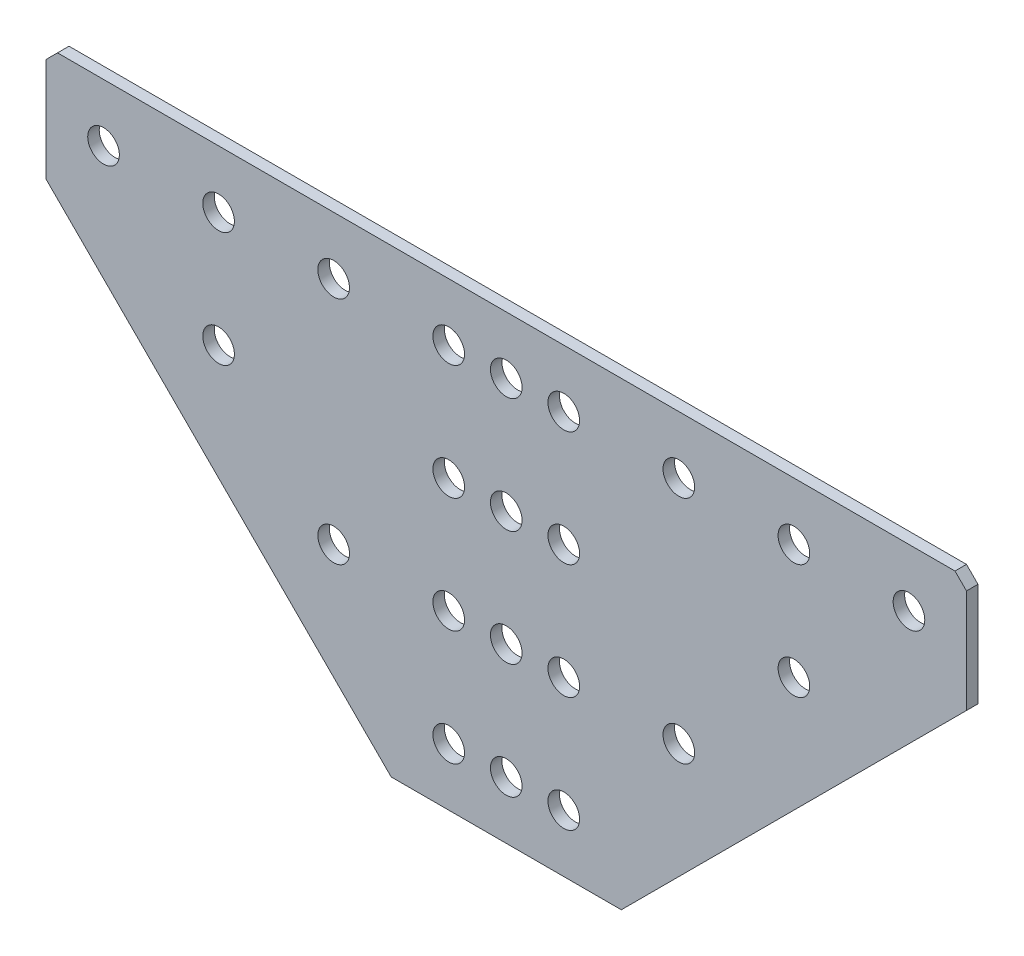
ISO-10303-21;
HEADER;
FILE_DESCRIPTION(('STEP AP214'),'2;1');
FILE_NAME('part.step','',(''),(''),'','','');
FILE_SCHEMA(('AUTOMOTIVE_DESIGN { 1 0 10303 214 1 1 1 1 }'));
ENDSEC;
DATA;
#1=APPLICATION_CONTEXT('core data for automotive mechanical design processes');
#2=APPLICATION_PROTOCOL_DEFINITION('international standard','automotive_design',2000,#1);
#3=PRODUCT_CONTEXT('',#1,'mechanical');
#4=PRODUCT('Part','Part','',(#3));
#5=PRODUCT_RELATED_PRODUCT_CATEGORY('part','',(#4));
#6=PRODUCT_DEFINITION_FORMATION('','',#4);
#7=PRODUCT_DEFINITION_CONTEXT('part definition',#1,'design');
#8=PRODUCT_DEFINITION('design','',#6,#7);
#9=PRODUCT_DEFINITION_SHAPE('','',#8);
#10=(LENGTH_UNIT() NAMED_UNIT(*) SI_UNIT(.MILLI.,.METRE.));
#11=(NAMED_UNIT(*) PLANE_ANGLE_UNIT() SI_UNIT($,.RADIAN.));
#12=(NAMED_UNIT(*) SI_UNIT($,.STERADIAN.) SOLID_ANGLE_UNIT());
#13=UNCERTAINTY_MEASURE_WITH_UNIT(LENGTH_MEASURE(1.E-05),#10,'distance_accuracy_value','');
#14=(GEOMETRIC_REPRESENTATION_CONTEXT(3) GLOBAL_UNCERTAINTY_ASSIGNED_CONTEXT((#13)) GLOBAL_UNIT_ASSIGNED_CONTEXT((#10,
#11,#12)) REPRESENTATION_CONTEXT('',''));
#15=CARTESIAN_POINT('',(0.,0.,0.));
#16=DIRECTION('',(0.,0.,1.));
#17=DIRECTION('',(1.,0.,0.));
#18=AXIS2_PLACEMENT_3D('',#15,#16,#17);
#19=CARTESIAN_POINT('',(0.,0.,-2.));
#20=DIRECTION('',(0.,-1.,0.));
#21=DIRECTION('',(0.,0.,-1.));
#22=AXIS2_PLACEMENT_3D('',#19,#20,#21);
#23=PLANE('',#22);
#24=DIRECTION('',(1.,0.,0.));
#25=VECTOR('',#24,1.);
#26=CARTESIAN_POINT('',(0.,0.,0.));
#27=LINE('',#26,#25);
#28=CARTESIAN_POINT('',(-20.,0.,0.));
#29=VERTEX_POINT('',#28);
#30=CARTESIAN_POINT('',(20.,0.,0.));
#31=VERTEX_POINT('',#30);
#32=EDGE_CURVE('E135',#29,#31,#27,.T.);
#33=ORIENTED_EDGE('',*,*,#32,.F.);
#34=DIRECTION('',(0.,0.,1.));
#35=VECTOR('',#34,1.);
#36=CARTESIAN_POINT('',(-20.,0.,-2.));
#37=LINE('',#36,#35);
#38=CARTESIAN_POINT('',(-20.,0.,-2.));
#39=VERTEX_POINT('',#38);
#40=EDGE_CURVE('E127',#39,#29,#37,.T.);
#41=ORIENTED_EDGE('',*,*,#40,.F.);
#42=DIRECTION('',(1.,0.,0.));
#43=VECTOR('',#42,1.);
#44=CARTESIAN_POINT('',(0.,0.,-2.));
#45=LINE('',#44,#43);
#46=CARTESIAN_POINT('',(20.,0.,-2.));
#47=VERTEX_POINT('',#46);
#48=EDGE_CURVE('E110',#39,#47,#45,.T.);
#49=ORIENTED_EDGE('',*,*,#48,.T.);
#50=DIRECTION('',(0.,0.,1.));
#51=VECTOR('',#50,1.);
#52=CARTESIAN_POINT('',(20.,0.,-2.));
#53=LINE('',#52,#51);
#54=EDGE_CURVE('E227',#47,#31,#53,.T.);
#55=ORIENTED_EDGE('',*,*,#54,.T.);
#56=EDGE_LOOP('',(#33,#41,#49,#55));
#57=FACE_BOUND('',#56,.T.);
#58=ADVANCED_FACE('F44',(#57),#23,.T.);
#59=CARTESIAN_POINT('',(0.,80.,-2.));
#60=DIRECTION('',(0.,1.,0.));
#61=DIRECTION('',(0.,0.,1.));
#62=AXIS2_PLACEMENT_3D('',#59,#60,#61);
#63=PLANE('',#62);
#64=DIRECTION('',(-1.,0.,0.));
#65=VECTOR('',#64,1.);
#66=CARTESIAN_POINT('',(0.,80.,0.));
#67=LINE('',#66,#65);
#68=CARTESIAN_POINT('',(78.,80.,0.));
#69=VERTEX_POINT('',#68);
#70=CARTESIAN_POINT('',(-78.,80.,0.));
#71=VERTEX_POINT('',#70);
#72=EDGE_CURVE('E122',#69,#71,#67,.T.);
#73=ORIENTED_EDGE('',*,*,#72,.F.);
#74=DIRECTION('',(0.,0.,-1.));
#75=VECTOR('',#74,1.);
#76=CARTESIAN_POINT('',(78.,80.,-2.));
#77=LINE('',#76,#75);
#78=CARTESIAN_POINT('',(78.,80.,-2.));
#79=VERTEX_POINT('',#78);
#80=EDGE_CURVE('E260',#69,#79,#77,.T.);
#81=ORIENTED_EDGE('',*,*,#80,.T.);
#82=DIRECTION('',(-1.,0.,0.));
#83=VECTOR('',#82,1.);
#84=CARTESIAN_POINT('',(0.,80.,-2.));
#85=LINE('',#84,#83);
#86=CARTESIAN_POINT('',(-78.,80.,-2.));
#87=VERTEX_POINT('',#86);
#88=EDGE_CURVE('E224',#79,#87,#85,.T.);
#89=ORIENTED_EDGE('',*,*,#88,.T.);
#90=DIRECTION('',(0.,0.,1.));
#91=VECTOR('',#90,1.);
#92=CARTESIAN_POINT('',(-78.,80.,-2.));
#93=LINE('',#92,#91);
#94=EDGE_CURVE('E256',#87,#71,#93,.T.);
#95=ORIENTED_EDGE('',*,*,#94,.T.);
#96=EDGE_LOOP('',(#73,#81,#89,#95));
#97=FACE_BOUND('',#96,.T.);
#98=ADVANCED_FACE('F279',(#97),#63,.T.);
#99=CARTESIAN_POINT('',(80.,80.,-2.));
#100=DIRECTION('',(1.,0.,0.));
#101=DIRECTION('',(0.,0.,-1.));
#102=AXIS2_PLACEMENT_3D('',#99,#100,#101);
#103=PLANE('',#102);
#104=DIRECTION('',(0.,1.,0.));
#105=VECTOR('',#104,1.);
#106=CARTESIAN_POINT('',(80.,80.,-2.));
#107=LINE('',#106,#105);
#108=CARTESIAN_POINT('',(80.,60.,-2.));
#109=VERTEX_POINT('',#108);
#110=CARTESIAN_POINT('',(80.,78.,-2.));
#111=VERTEX_POINT('',#110);
#112=EDGE_CURVE('E220',#109,#111,#107,.T.);
#113=ORIENTED_EDGE('',*,*,#112,.T.);
#114=DIRECTION('',(0.,0.,1.));
#115=VECTOR('',#114,1.);
#116=CARTESIAN_POINT('',(80.,78.,-2.));
#117=LINE('',#116,#115);
#118=CARTESIAN_POINT('',(80.,78.,0.));
#119=VERTEX_POINT('',#118);
#120=EDGE_CURVE('E244',#111,#119,#117,.T.);
#121=ORIENTED_EDGE('',*,*,#120,.T.);
#122=DIRECTION('',(0.,1.,0.));
#123=VECTOR('',#122,1.);
#124=CARTESIAN_POINT('',(80.,80.,0.));
#125=LINE('',#124,#123);
#126=CARTESIAN_POINT('',(80.,60.,0.));
#127=VERTEX_POINT('',#126);
#128=EDGE_CURVE('E234',#127,#119,#125,.T.);
#129=ORIENTED_EDGE('',*,*,#128,.F.);
#130=DIRECTION('',(0.,0.,1.));
#131=VECTOR('',#130,1.);
#132=CARTESIAN_POINT('',(80.,60.,-2.));
#133=LINE('',#132,#131);
#134=EDGE_CURVE('E241',#109,#127,#133,.T.);
#135=ORIENTED_EDGE('',*,*,#134,.F.);
#136=EDGE_LOOP('',(#113,#121,#129,#135));
#137=FACE_BOUND('',#136,.T.);
#138=ADVANCED_FACE('F271',(#137),#103,.T.);
#139=CARTESIAN_POINT('',(80.,60.,-2.));
#140=DIRECTION('',(0.707106781186547,-0.707106781186547,0.));
#141=DIRECTION('',(0.707106781186548,0.707106781186548,0.));
#142=AXIS2_PLACEMENT_3D('',#139,#140,#141);
#143=PLANE('',#142);
#144=DIRECTION('',(0.707106781186547,0.707106781186547,0.));
#145=VECTOR('',#144,1.);
#146=CARTESIAN_POINT('',(80.,60.,0.));
#147=LINE('',#146,#145);
#148=EDGE_CURVE('E230',#31,#127,#147,.T.);
#149=ORIENTED_EDGE('',*,*,#148,.F.);
#150=ORIENTED_EDGE('',*,*,#54,.F.);
#151=DIRECTION('',(0.707106781186547,0.707106781186547,0.));
#152=VECTOR('',#151,1.);
#153=CARTESIAN_POINT('',(80.,60.,-2.));
#154=LINE('',#153,#152);
#155=EDGE_CURVE('E118',#47,#109,#154,.T.);
#156=ORIENTED_EDGE('',*,*,#155,.T.);
#157=ORIENTED_EDGE('',*,*,#134,.T.);
#158=EDGE_LOOP('',(#149,#150,#156,#157));
#159=FACE_BOUND('',#158,.T.);
#160=ADVANCED_FACE('F401',(#159),#143,.T.);
#161=CARTESIAN_POINT('',(0.,0.,-2.));
#162=DIRECTION('',(0.,0.,-1.));
#163=DIRECTION('',(-1.,0.,0.));
#164=AXIS2_PLACEMENT_3D('',#161,#162,#163);
#165=PLANE('',#164);
#166=CARTESIAN_POINT('',(0.,70.,-2.));
#167=DIRECTION('',(0.,0.,-1.));
#168=DIRECTION('',(-1.,0.,0.));
#169=AXIS2_PLACEMENT_3D('',#166,#167,#168);
#170=CIRCLE('',#169,2.74999999999999);
#171=CARTESIAN_POINT('',(-2.74999999999999,70.,-2.));
#172=VERTEX_POINT('',#171);
#173=EDGE_CURVE('E390',#172,#172,#170,.T.);
#174=ORIENTED_EDGE('',*,*,#173,.F.);
#175=EDGE_LOOP('',(#174));
#176=FACE_BOUND('',#175,.T.);
#177=CARTESIAN_POINT('',(-2.09488880330588E-13,50.,-2.));
#178=DIRECTION('',(0.,0.,-1.));
#179=DIRECTION('',(-1.,0.,0.));
#180=AXIS2_PLACEMENT_3D('',#177,#178,#179);
#181=CIRCLE('',#180,2.74999999999999);
#182=CARTESIAN_POINT('',(-2.7500000000002,50.,-2.));
#183=VERTEX_POINT('',#182);
#184=EDGE_CURVE('E382',#183,#183,#181,.T.);
#185=ORIENTED_EDGE('',*,*,#184,.F.);
#186=EDGE_LOOP('',(#185));
#187=FACE_BOUND('',#186,.T.);
#188=CARTESIAN_POINT('',(-4.18977760661176E-13,30.,-2.));
#189=DIRECTION('',(0.,0.,-1.));
#190=DIRECTION('',(-1.,0.,0.));
#191=AXIS2_PLACEMENT_3D('',#188,#189,#190);
#192=CIRCLE('',#191,2.74999999999999);
#193=CARTESIAN_POINT('',(-2.75000000000041,30.,-2.));
#194=VERTEX_POINT('',#193);
#195=EDGE_CURVE('E374',#194,#194,#192,.T.);
#196=ORIENTED_EDGE('',*,*,#195,.F.);
#197=EDGE_LOOP('',(#196));
#198=FACE_BOUND('',#197,.T.);
#199=CARTESIAN_POINT('',(-6.28466640991764E-13,9.99999999999999,-2.));
#200=DIRECTION('',(0.,0.,-1.));
#201=DIRECTION('',(-1.,0.,0.));
#202=AXIS2_PLACEMENT_3D('',#199,#200,#201);
#203=CIRCLE('',#202,2.74999999999999);
#204=CARTESIAN_POINT('',(-2.75000000000062,9.99999999999999,-2.));
#205=VERTEX_POINT('',#204);
#206=EDGE_CURVE('E366',#205,#205,#203,.T.);
#207=ORIENTED_EDGE('',*,*,#206,.F.);
#208=EDGE_LOOP('',(#207));
#209=FACE_BOUND('',#208,.T.);
#210=CARTESIAN_POINT('',(10.,30.,-2.));
#211=DIRECTION('',(0.,0.,-1.));
#212=DIRECTION('',(-1.,0.,0.));
#213=AXIS2_PLACEMENT_3D('',#210,#211,#212);
#214=CIRCLE('',#213,2.75);
#215=CARTESIAN_POINT('',(7.25,30.,-2.));
#216=VERTEX_POINT('',#215);
#217=EDGE_CURVE('E150',#216,#216,#214,.T.);
#218=ORIENTED_EDGE('',*,*,#217,.F.);
#219=EDGE_LOOP('',(#218));
#220=FACE_BOUND('',#219,.T.);
#221=CARTESIAN_POINT('',(50.,70.,-2.));
#222=DIRECTION('',(0.,0.,-1.));
#223=DIRECTION('',(-1.,0.,0.));
#224=AXIS2_PLACEMENT_3D('',#221,#222,#223);
#225=CIRCLE('',#224,2.75);
#226=CARTESIAN_POINT('',(47.25,70.,-2.));
#227=VERTEX_POINT('',#226);
#228=EDGE_CURVE('E158',#227,#227,#225,.T.);
#229=ORIENTED_EDGE('',*,*,#228,.F.);
#230=EDGE_LOOP('',(#229));
#231=FACE_BOUND('',#230,.T.);
#232=CARTESIAN_POINT('',(70.,70.,-2.));
#233=DIRECTION('',(0.,0.,-1.));
#234=DIRECTION('',(-1.,0.,0.));
#235=AXIS2_PLACEMENT_3D('',#232,#233,#234);
#236=CIRCLE('',#235,2.75);
#237=CARTESIAN_POINT('',(67.25,70.,-2.));
#238=VERTEX_POINT('',#237);
#239=EDGE_CURVE('E166',#238,#238,#236,.T.);
#240=ORIENTED_EDGE('',*,*,#239,.F.);
#241=EDGE_LOOP('',(#240));
#242=FACE_BOUND('',#241,.T.);
#243=CARTESIAN_POINT('',(30.,70.,-2.));
#244=DIRECTION('',(0.,0.,-1.));
#245=DIRECTION('',(-1.,0.,0.));
#246=AXIS2_PLACEMENT_3D('',#243,#244,#245);
#247=CIRCLE('',#246,2.75);
#248=CARTESIAN_POINT('',(27.25,70.,-2.));
#249=VERTEX_POINT('',#248);
#250=EDGE_CURVE('E174',#249,#249,#247,.T.);
#251=ORIENTED_EDGE('',*,*,#250,.F.);
#252=EDGE_LOOP('',(#251));
#253=FACE_BOUND('',#252,.T.);
#254=CARTESIAN_POINT('',(10.,70.,-2.));
#255=DIRECTION('',(0.,0.,-1.));
#256=DIRECTION('',(-1.,0.,0.));
#257=AXIS2_PLACEMENT_3D('',#254,#255,#256);
#258=CIRCLE('',#257,2.75);
#259=CARTESIAN_POINT('',(7.25,70.,-2.));
#260=VERTEX_POINT('',#259);
#261=EDGE_CURVE('E182',#260,#260,#258,.T.);
#262=ORIENTED_EDGE('',*,*,#261,.F.);
#263=EDGE_LOOP('',(#262));
#264=FACE_BOUND('',#263,.T.);
#265=CARTESIAN_POINT('',(10.,9.99999999999999,-2.));
#266=DIRECTION('',(0.,0.,-1.));
#267=DIRECTION('',(-1.,0.,0.));
#268=AXIS2_PLACEMENT_3D('',#265,#266,#267);
#269=CIRCLE('',#268,2.75);
#270=CARTESIAN_POINT('',(7.25000000000001,9.99999999999999,-2.));
#271=VERTEX_POINT('',#270);
#272=EDGE_CURVE('E190',#271,#271,#269,.T.);
#273=ORIENTED_EDGE('',*,*,#272,.F.);
#274=EDGE_LOOP('',(#273));
#275=FACE_BOUND('',#274,.T.);
#276=CARTESIAN_POINT('',(10.,50.,-2.));
#277=DIRECTION('',(0.,0.,-1.));
#278=DIRECTION('',(-1.,0.,0.));
#279=AXIS2_PLACEMENT_3D('',#276,#277,#278);
#280=CIRCLE('',#279,2.75);
#281=CARTESIAN_POINT('',(7.25,50.,-2.));
#282=VERTEX_POINT('',#281);
#283=EDGE_CURVE('E198',#282,#282,#280,.T.);
#284=ORIENTED_EDGE('',*,*,#283,.F.);
#285=EDGE_LOOP('',(#284));
#286=FACE_BOUND('',#285,.T.);
#287=CARTESIAN_POINT('',(30.,30.,-2.));
#288=DIRECTION('',(0.,0.,-1.));
#289=DIRECTION('',(-1.,0.,0.));
#290=AXIS2_PLACEMENT_3D('',#287,#288,#289);
#291=CIRCLE('',#290,2.75);
#292=CARTESIAN_POINT('',(27.25,30.,-2.));
#293=VERTEX_POINT('',#292);
#294=EDGE_CURVE('E206',#293,#293,#291,.T.);
#295=ORIENTED_EDGE('',*,*,#294,.F.);
#296=EDGE_LOOP('',(#295));
#297=FACE_BOUND('',#296,.T.);
#298=CARTESIAN_POINT('',(50.,50.,-2.));
#299=DIRECTION('',(0.,0.,-1.));
#300=DIRECTION('',(-1.,0.,0.));
#301=AXIS2_PLACEMENT_3D('',#298,#299,#300);
#302=CIRCLE('',#301,2.75);
#303=CARTESIAN_POINT('',(47.25,50.,-2.));
#304=VERTEX_POINT('',#303);
#305=EDGE_CURVE('E214',#304,#304,#302,.T.);
#306=ORIENTED_EDGE('',*,*,#305,.F.);
#307=EDGE_LOOP('',(#306));
#308=FACE_BOUND('',#307,.T.);
#309=ORIENTED_EDGE('',*,*,#88,.F.);
#310=DIRECTION('',(-0.707106781186552,0.707106781186543,0.));
#311=VECTOR('',#310,1.);
#312=CARTESIAN_POINT('',(78.9999999999994,79.0000000000005,-2.));
#313=LINE('',#312,#311);
#314=EDGE_CURVE('E53',#79,#111,#313,.F.);
#315=ORIENTED_EDGE('',*,*,#314,.T.);
#316=ORIENTED_EDGE('',*,*,#112,.F.);
#317=ORIENTED_EDGE('',*,*,#155,.F.);
#318=ORIENTED_EDGE('',*,*,#48,.F.);
#319=DIRECTION('',(-0.707106781186547,0.707106781186547,0.));
#320=VECTOR('',#319,1.);
#321=CARTESIAN_POINT('',(-80.,60.,-2.));
#322=LINE('',#321,#320);
#323=CARTESIAN_POINT('',(-80.,60.,-2.));
#324=VERTEX_POINT('',#323);
#325=EDGE_CURVE('E114',#39,#324,#322,.T.);
#326=ORIENTED_EDGE('',*,*,#325,.T.);
#327=DIRECTION('',(0.,1.,0.));
#328=VECTOR('',#327,1.);
#329=CARTESIAN_POINT('',(-80.,80.,-2.));
#330=LINE('',#329,#328);
#331=CARTESIAN_POINT('',(-80.,78.,-2.));
#332=VERTEX_POINT('',#331);
#333=EDGE_CURVE('E131',#324,#332,#330,.T.);
#334=ORIENTED_EDGE('',*,*,#333,.T.);
#335=DIRECTION('',(-0.707106781186543,-0.707106781186552,0.));
#336=VECTOR('',#335,1.);
#337=CARTESIAN_POINT('',(-79.0000000000005,78.9999999999994,-2.));
#338=LINE('',#337,#336);
#339=EDGE_CURVE('E65',#332,#87,#338,.F.);
#340=ORIENTED_EDGE('',*,*,#339,.T.);
#341=EDGE_LOOP('',(#309,#315,#316,#317,#318,#326,#334,#340));
#342=FACE_BOUND('',#341,.T.);
#343=CARTESIAN_POINT('',(-10.,30.,-2.));
#344=DIRECTION('',(0.,0.,1.));
#345=DIRECTION('',(1.,0.,0.));
#346=AXIS2_PLACEMENT_3D('',#343,#344,#345);
#347=CIRCLE('',#346,2.75);
#348=CARTESIAN_POINT('',(-7.25,30.,-2.));
#349=VERTEX_POINT('',#348);
#350=EDGE_CURVE('E354',#349,#349,#347,.T.);
#351=ORIENTED_EDGE('',*,*,#350,.T.);
#352=EDGE_LOOP('',(#351));
#353=FACE_BOUND('',#352,.T.);
#354=CARTESIAN_POINT('',(-50.,70.,-2.));
#355=DIRECTION('',(0.,0.,1.));
#356=DIRECTION('',(1.,0.,0.));
#357=AXIS2_PLACEMENT_3D('',#354,#355,#356);
#358=CIRCLE('',#357,2.75);
#359=CARTESIAN_POINT('',(-47.25,70.,-2.));
#360=VERTEX_POINT('',#359);
#361=EDGE_CURVE('E346',#360,#360,#358,.T.);
#362=ORIENTED_EDGE('',*,*,#361,.T.);
#363=EDGE_LOOP('',(#362));
#364=FACE_BOUND('',#363,.T.);
#365=CARTESIAN_POINT('',(-70.,70.,-2.));
#366=DIRECTION('',(0.,0.,1.));
#367=DIRECTION('',(1.,0.,0.));
#368=AXIS2_PLACEMENT_3D('',#365,#366,#367);
#369=CIRCLE('',#368,2.75);
#370=CARTESIAN_POINT('',(-67.25,70.,-2.));
#371=VERTEX_POINT('',#370);
#372=EDGE_CURVE('E338',#371,#371,#369,.T.);
#373=ORIENTED_EDGE('',*,*,#372,.T.);
#374=EDGE_LOOP('',(#373));
#375=FACE_BOUND('',#374,.T.);
#376=CARTESIAN_POINT('',(-30.,70.,-2.));
#377=DIRECTION('',(0.,0.,1.));
#378=DIRECTION('',(1.,0.,0.));
#379=AXIS2_PLACEMENT_3D('',#376,#377,#378);
#380=CIRCLE('',#379,2.75);
#381=CARTESIAN_POINT('',(-27.25,70.,-2.));
#382=VERTEX_POINT('',#381);
#383=EDGE_CURVE('E330',#382,#382,#380,.T.);
#384=ORIENTED_EDGE('',*,*,#383,.T.);
#385=EDGE_LOOP('',(#384));
#386=FACE_BOUND('',#385,.T.);
#387=CARTESIAN_POINT('',(-10.,70.,-2.));
#388=DIRECTION('',(0.,0.,1.));
#389=DIRECTION('',(1.,0.,0.));
#390=AXIS2_PLACEMENT_3D('',#387,#388,#389);
#391=CIRCLE('',#390,2.75);
#392=CARTESIAN_POINT('',(-7.25,70.,-2.));
#393=VERTEX_POINT('',#392);
#394=EDGE_CURVE('E322',#393,#393,#391,.T.);
#395=ORIENTED_EDGE('',*,*,#394,.T.);
#396=EDGE_LOOP('',(#395));
#397=FACE_BOUND('',#396,.T.);
#398=CARTESIAN_POINT('',(-10.,9.99999999999999,-2.));
#399=DIRECTION('',(0.,0.,1.));
#400=DIRECTION('',(1.,0.,0.));
#401=AXIS2_PLACEMENT_3D('',#398,#399,#400);
#402=CIRCLE('',#401,2.75);
#403=CARTESIAN_POINT('',(-7.25000000000001,9.99999999999999,-2.));
#404=VERTEX_POINT('',#403);
#405=EDGE_CURVE('E314',#404,#404,#402,.T.);
#406=ORIENTED_EDGE('',*,*,#405,.T.);
#407=EDGE_LOOP('',(#406));
#408=FACE_BOUND('',#407,.T.);
#409=CARTESIAN_POINT('',(-10.,50.,-2.));
#410=DIRECTION('',(0.,0.,1.));
#411=DIRECTION('',(1.,0.,0.));
#412=AXIS2_PLACEMENT_3D('',#409,#410,#411);
#413=CIRCLE('',#412,2.75);
#414=CARTESIAN_POINT('',(-7.25,50.,-2.));
#415=VERTEX_POINT('',#414);
#416=EDGE_CURVE('E306',#415,#415,#413,.T.);
#417=ORIENTED_EDGE('',*,*,#416,.T.);
#418=EDGE_LOOP('',(#417));
#419=FACE_BOUND('',#418,.T.);
#420=CARTESIAN_POINT('',(-30.,30.,-2.));
#421=DIRECTION('',(0.,0.,1.));
#422=DIRECTION('',(1.,0.,0.));
#423=AXIS2_PLACEMENT_3D('',#420,#421,#422);
#424=CIRCLE('',#423,2.75);
#425=CARTESIAN_POINT('',(-27.25,30.,-2.));
#426=VERTEX_POINT('',#425);
#427=EDGE_CURVE('E298',#426,#426,#424,.T.);
#428=ORIENTED_EDGE('',*,*,#427,.T.);
#429=EDGE_LOOP('',(#428));
#430=FACE_BOUND('',#429,.T.);
#431=CARTESIAN_POINT('',(-50.,50.,-2.));
#432=DIRECTION('',(0.,0.,1.));
#433=DIRECTION('',(1.,0.,0.));
#434=AXIS2_PLACEMENT_3D('',#431,#432,#433);
#435=CIRCLE('',#434,2.75);
#436=CARTESIAN_POINT('',(-47.25,50.,-2.));
#437=VERTEX_POINT('',#436);
#438=EDGE_CURVE('E288',#437,#437,#435,.T.);
#439=ORIENTED_EDGE('',*,*,#438,.T.);
#440=EDGE_LOOP('',(#439));
#441=FACE_BOUND('',#440,.T.);
#442=ADVANCED_FACE('F112',(#176,#187,#198,#209,#220,#231,#242,#253,#264,#275,#286,#297,#308,
#342,#353,#364,#375,#386,#397,#408,#419,#430,#441),#165,.T.);
#443=CARTESIAN_POINT('',(0.,0.,0.));
#444=DIRECTION('',(0.,0.,-1.));
#445=DIRECTION('',(-1.,0.,0.));
#446=AXIS2_PLACEMENT_3D('',#443,#444,#445);
#447=PLANE('',#446);
#448=CARTESIAN_POINT('',(0.,70.,0.));
#449=DIRECTION('',(0.,0.,-1.));
#450=DIRECTION('',(-1.,0.,0.));
#451=AXIS2_PLACEMENT_3D('',#448,#449,#450);
#452=CIRCLE('',#451,2.74999999999999);
#453=CARTESIAN_POINT('',(-2.74999999999999,70.,0.));
#454=VERTEX_POINT('',#453);
#455=EDGE_CURVE('E386',#454,#454,#452,.T.);
#456=ORIENTED_EDGE('',*,*,#455,.T.);
#457=EDGE_LOOP('',(#456));
#458=FACE_BOUND('',#457,.T.);
#459=CARTESIAN_POINT('',(-2.09488880330588E-13,50.,0.));
#460=DIRECTION('',(0.,0.,-1.));
#461=DIRECTION('',(-1.,0.,0.));
#462=AXIS2_PLACEMENT_3D('',#459,#460,#461);
#463=CIRCLE('',#462,2.74999999999999);
#464=CARTESIAN_POINT('',(-2.7500000000002,50.,0.));
#465=VERTEX_POINT('',#464);
#466=EDGE_CURVE('E378',#465,#465,#463,.T.);
#467=ORIENTED_EDGE('',*,*,#466,.T.);
#468=EDGE_LOOP('',(#467));
#469=FACE_BOUND('',#468,.T.);
#470=CARTESIAN_POINT('',(-4.18977760661176E-13,30.,0.));
#471=DIRECTION('',(0.,0.,-1.));
#472=DIRECTION('',(-1.,0.,0.));
#473=AXIS2_PLACEMENT_3D('',#470,#471,#472);
#474=CIRCLE('',#473,2.74999999999999);
#475=CARTESIAN_POINT('',(-2.75000000000041,30.,0.));
#476=VERTEX_POINT('',#475);
#477=EDGE_CURVE('E370',#476,#476,#474,.T.);
#478=ORIENTED_EDGE('',*,*,#477,.T.);
#479=EDGE_LOOP('',(#478));
#480=FACE_BOUND('',#479,.T.);
#481=CARTESIAN_POINT('',(-6.28466640991764E-13,9.99999999999999,0.));
#482=DIRECTION('',(0.,0.,-1.));
#483=DIRECTION('',(-1.,0.,0.));
#484=AXIS2_PLACEMENT_3D('',#481,#482,#483);
#485=CIRCLE('',#484,2.74999999999999);
#486=CARTESIAN_POINT('',(-2.75000000000062,9.99999999999999,0.));
#487=VERTEX_POINT('',#486);
#488=EDGE_CURVE('E362',#487,#487,#485,.T.);
#489=ORIENTED_EDGE('',*,*,#488,.T.);
#490=EDGE_LOOP('',(#489));
#491=FACE_BOUND('',#490,.T.);
#492=CARTESIAN_POINT('',(10.,30.,0.));
#493=DIRECTION('',(0.,0.,1.));
#494=DIRECTION('',(1.,0.,0.));
#495=AXIS2_PLACEMENT_3D('',#492,#493,#494);
#496=CIRCLE('',#495,2.75);
#497=CARTESIAN_POINT('',(12.75,30.,0.));
#498=VERTEX_POINT('',#497);
#499=EDGE_CURVE('E142',#498,#498,#496,.T.);
#500=ORIENTED_EDGE('',*,*,#499,.F.);
#501=EDGE_LOOP('',(#500));
#502=FACE_BOUND('',#501,.T.);
#503=CARTESIAN_POINT('',(50.,70.,0.));
#504=DIRECTION('',(0.,0.,1.));
#505=DIRECTION('',(1.,0.,0.));
#506=AXIS2_PLACEMENT_3D('',#503,#504,#505);
#507=CIRCLE('',#506,2.75);
#508=CARTESIAN_POINT('',(52.75,70.,0.));
#509=VERTEX_POINT('',#508);
#510=EDGE_CURVE('E154',#509,#509,#507,.T.);
#511=ORIENTED_EDGE('',*,*,#510,.F.);
#512=EDGE_LOOP('',(#511));
#513=FACE_BOUND('',#512,.T.);
#514=CARTESIAN_POINT('',(70.,70.,0.));
#515=DIRECTION('',(0.,0.,1.));
#516=DIRECTION('',(1.,0.,0.));
#517=AXIS2_PLACEMENT_3D('',#514,#515,#516);
#518=CIRCLE('',#517,2.75);
#519=CARTESIAN_POINT('',(72.75,70.,0.));
#520=VERTEX_POINT('',#519);
#521=EDGE_CURVE('E162',#520,#520,#518,.T.);
#522=ORIENTED_EDGE('',*,*,#521,.F.);
#523=EDGE_LOOP('',(#522));
#524=FACE_BOUND('',#523,.T.);
#525=CARTESIAN_POINT('',(30.,70.,0.));
#526=DIRECTION('',(0.,0.,1.));
#527=DIRECTION('',(1.,0.,0.));
#528=AXIS2_PLACEMENT_3D('',#525,#526,#527);
#529=CIRCLE('',#528,2.75);
#530=CARTESIAN_POINT('',(32.75,70.,0.));
#531=VERTEX_POINT('',#530);
#532=EDGE_CURVE('E170',#531,#531,#529,.T.);
#533=ORIENTED_EDGE('',*,*,#532,.F.);
#534=EDGE_LOOP('',(#533));
#535=FACE_BOUND('',#534,.T.);
#536=CARTESIAN_POINT('',(10.,70.,0.));
#537=DIRECTION('',(0.,0.,1.));
#538=DIRECTION('',(1.,0.,0.));
#539=AXIS2_PLACEMENT_3D('',#536,#537,#538);
#540=CIRCLE('',#539,2.75);
#541=CARTESIAN_POINT('',(12.75,70.,0.));
#542=VERTEX_POINT('',#541);
#543=EDGE_CURVE('E178',#542,#542,#540,.T.);
#544=ORIENTED_EDGE('',*,*,#543,.F.);
#545=EDGE_LOOP('',(#544));
#546=FACE_BOUND('',#545,.T.);
#547=CARTESIAN_POINT('',(10.,9.99999999999999,0.));
#548=DIRECTION('',(0.,0.,1.));
#549=DIRECTION('',(1.,0.,0.));
#550=AXIS2_PLACEMENT_3D('',#547,#548,#549);
#551=CIRCLE('',#550,2.75);
#552=CARTESIAN_POINT('',(12.75,9.99999999999999,0.));
#553=VERTEX_POINT('',#552);
#554=EDGE_CURVE('E186',#553,#553,#551,.T.);
#555=ORIENTED_EDGE('',*,*,#554,.F.);
#556=EDGE_LOOP('',(#555));
#557=FACE_BOUND('',#556,.T.);
#558=CARTESIAN_POINT('',(10.,50.,0.));
#559=DIRECTION('',(0.,0.,1.));
#560=DIRECTION('',(1.,0.,0.));
#561=AXIS2_PLACEMENT_3D('',#558,#559,#560);
#562=CIRCLE('',#561,2.75);
#563=CARTESIAN_POINT('',(12.75,50.,0.));
#564=VERTEX_POINT('',#563);
#565=EDGE_CURVE('E194',#564,#564,#562,.T.);
#566=ORIENTED_EDGE('',*,*,#565,.F.);
#567=EDGE_LOOP('',(#566));
#568=FACE_BOUND('',#567,.T.);
#569=CARTESIAN_POINT('',(30.,30.,0.));
#570=DIRECTION('',(0.,0.,1.));
#571=DIRECTION('',(1.,0.,0.));
#572=AXIS2_PLACEMENT_3D('',#569,#570,#571);
#573=CIRCLE('',#572,2.75);
#574=CARTESIAN_POINT('',(32.75,30.,0.));
#575=VERTEX_POINT('',#574);
#576=EDGE_CURVE('E202',#575,#575,#573,.T.);
#577=ORIENTED_EDGE('',*,*,#576,.F.);
#578=EDGE_LOOP('',(#577));
#579=FACE_BOUND('',#578,.T.);
#580=CARTESIAN_POINT('',(50.,50.,0.));
#581=DIRECTION('',(0.,0.,1.));
#582=DIRECTION('',(1.,0.,0.));
#583=AXIS2_PLACEMENT_3D('',#580,#581,#582);
#584=CIRCLE('',#583,2.75);
#585=CARTESIAN_POINT('',(52.75,50.,0.));
#586=VERTEX_POINT('',#585);
#587=EDGE_CURVE('E210',#586,#586,#584,.T.);
#588=ORIENTED_EDGE('',*,*,#587,.F.);
#589=EDGE_LOOP('',(#588));
#590=FACE_BOUND('',#589,.T.);
#591=ORIENTED_EDGE('',*,*,#128,.T.);
#592=DIRECTION('',(0.707106781186552,-0.707106781186543,0.));
#593=VECTOR('',#592,1.);
#594=CARTESIAN_POINT('',(80.,78.,0.));
#595=LINE('',#594,#593);
#596=EDGE_CURVE('E253',#119,#69,#595,.F.);
#597=ORIENTED_EDGE('',*,*,#596,.T.);
#598=ORIENTED_EDGE('',*,*,#72,.T.);
#599=DIRECTION('',(0.707106781186543,0.707106781186552,0.));
#600=VECTOR('',#599,1.);
#601=CARTESIAN_POINT('',(-78.,80.,0.));
#602=LINE('',#601,#600);
#603=CARTESIAN_POINT('',(-80.,78.,0.));
#604=VERTEX_POINT('',#603);
#605=EDGE_CURVE('E250',#71,#604,#602,.F.);
#606=ORIENTED_EDGE('',*,*,#605,.T.);
#607=DIRECTION('',(0.,1.,0.));
#608=VECTOR('',#607,1.);
#609=CARTESIAN_POINT('',(-80.,80.,0.));
#610=LINE('',#609,#608);
#611=CARTESIAN_POINT('',(-80.,60.,0.));
#612=VERTEX_POINT('',#611);
#613=EDGE_CURVE('E132',#612,#604,#610,.T.);
#614=ORIENTED_EDGE('',*,*,#613,.F.);
#615=DIRECTION('',(-0.707106781186547,0.707106781186547,0.));
#616=VECTOR('',#615,1.);
#617=CARTESIAN_POINT('',(-80.,60.,0.));
#618=LINE('',#617,#616);
#619=EDGE_CURVE('E285',#29,#612,#618,.T.);
#620=ORIENTED_EDGE('',*,*,#619,.F.);
#621=ORIENTED_EDGE('',*,*,#32,.T.);
#622=ORIENTED_EDGE('',*,*,#148,.T.);
#623=EDGE_LOOP('',(#591,#597,#598,#606,#614,#620,#621,#622));
#624=FACE_BOUND('',#623,.T.);
#625=CARTESIAN_POINT('',(-10.,30.,0.));
#626=DIRECTION('',(0.,0.,-1.));
#627=DIRECTION('',(-1.,0.,0.));
#628=AXIS2_PLACEMENT_3D('',#625,#626,#627);
#629=CIRCLE('',#628,2.75);
#630=CARTESIAN_POINT('',(-12.75,30.,0.));
#631=VERTEX_POINT('',#630);
#632=EDGE_CURVE('E358',#631,#631,#629,.T.);
#633=ORIENTED_EDGE('',*,*,#632,.T.);
#634=EDGE_LOOP('',(#633));
#635=FACE_BOUND('',#634,.T.);
#636=CARTESIAN_POINT('',(-50.,70.,0.));
#637=DIRECTION('',(0.,0.,-1.));
#638=DIRECTION('',(-1.,0.,0.));
#639=AXIS2_PLACEMENT_3D('',#636,#637,#638);
#640=CIRCLE('',#639,2.75);
#641=CARTESIAN_POINT('',(-52.75,70.,0.));
#642=VERTEX_POINT('',#641);
#643=EDGE_CURVE('E350',#642,#642,#640,.T.);
#644=ORIENTED_EDGE('',*,*,#643,.T.);
#645=EDGE_LOOP('',(#644));
#646=FACE_BOUND('',#645,.T.);
#647=CARTESIAN_POINT('',(-70.,70.,0.));
#648=DIRECTION('',(0.,0.,-1.));
#649=DIRECTION('',(-1.,0.,0.));
#650=AXIS2_PLACEMENT_3D('',#647,#648,#649);
#651=CIRCLE('',#650,2.75);
#652=CARTESIAN_POINT('',(-72.75,70.,0.));
#653=VERTEX_POINT('',#652);
#654=EDGE_CURVE('E342',#653,#653,#651,.T.);
#655=ORIENTED_EDGE('',*,*,#654,.T.);
#656=EDGE_LOOP('',(#655));
#657=FACE_BOUND('',#656,.T.);
#658=CARTESIAN_POINT('',(-30.,70.,0.));
#659=DIRECTION('',(0.,0.,-1.));
#660=DIRECTION('',(-1.,0.,0.));
#661=AXIS2_PLACEMENT_3D('',#658,#659,#660);
#662=CIRCLE('',#661,2.75);
#663=CARTESIAN_POINT('',(-32.75,70.,0.));
#664=VERTEX_POINT('',#663);
#665=EDGE_CURVE('E334',#664,#664,#662,.T.);
#666=ORIENTED_EDGE('',*,*,#665,.T.);
#667=EDGE_LOOP('',(#666));
#668=FACE_BOUND('',#667,.T.);
#669=CARTESIAN_POINT('',(-10.,70.,0.));
#670=DIRECTION('',(0.,0.,-1.));
#671=DIRECTION('',(-1.,0.,0.));
#672=AXIS2_PLACEMENT_3D('',#669,#670,#671);
#673=CIRCLE('',#672,2.75);
#674=CARTESIAN_POINT('',(-12.75,70.,0.));
#675=VERTEX_POINT('',#674);
#676=EDGE_CURVE('E326',#675,#675,#673,.T.);
#677=ORIENTED_EDGE('',*,*,#676,.T.);
#678=EDGE_LOOP('',(#677));
#679=FACE_BOUND('',#678,.T.);
#680=CARTESIAN_POINT('',(-10.,9.99999999999999,0.));
#681=DIRECTION('',(0.,0.,-1.));
#682=DIRECTION('',(-1.,0.,0.));
#683=AXIS2_PLACEMENT_3D('',#680,#681,#682);
#684=CIRCLE('',#683,2.75);
#685=CARTESIAN_POINT('',(-12.75,9.99999999999999,0.));
#686=VERTEX_POINT('',#685);
#687=EDGE_CURVE('E318',#686,#686,#684,.T.);
#688=ORIENTED_EDGE('',*,*,#687,.T.);
#689=EDGE_LOOP('',(#688));
#690=FACE_BOUND('',#689,.T.);
#691=CARTESIAN_POINT('',(-10.,50.,0.));
#692=DIRECTION('',(0.,0.,-1.));
#693=DIRECTION('',(-1.,0.,0.));
#694=AXIS2_PLACEMENT_3D('',#691,#692,#693);
#695=CIRCLE('',#694,2.75);
#696=CARTESIAN_POINT('',(-12.75,50.,0.));
#697=VERTEX_POINT('',#696);
#698=EDGE_CURVE('E310',#697,#697,#695,.T.);
#699=ORIENTED_EDGE('',*,*,#698,.T.);
#700=EDGE_LOOP('',(#699));
#701=FACE_BOUND('',#700,.T.);
#702=CARTESIAN_POINT('',(-30.,30.,0.));
#703=DIRECTION('',(0.,0.,-1.));
#704=DIRECTION('',(-1.,0.,0.));
#705=AXIS2_PLACEMENT_3D('',#702,#703,#704);
#706=CIRCLE('',#705,2.75);
#707=CARTESIAN_POINT('',(-32.75,30.,0.));
#708=VERTEX_POINT('',#707);
#709=EDGE_CURVE('E302',#708,#708,#706,.T.);
#710=ORIENTED_EDGE('',*,*,#709,.T.);
#711=EDGE_LOOP('',(#710));
#712=FACE_BOUND('',#711,.T.);
#713=CARTESIAN_POINT('',(-50.,50.,0.));
#714=DIRECTION('',(0.,0.,-1.));
#715=DIRECTION('',(-1.,0.,0.));
#716=AXIS2_PLACEMENT_3D('',#713,#714,#715);
#717=CIRCLE('',#716,2.75);
#718=CARTESIAN_POINT('',(-52.75,50.,0.));
#719=VERTEX_POINT('',#718);
#720=EDGE_CURVE('E294',#719,#719,#717,.T.);
#721=ORIENTED_EDGE('',*,*,#720,.T.);
#722=EDGE_LOOP('',(#721));
#723=FACE_BOUND('',#722,.T.);
#724=ADVANCED_FACE('F276',(#458,#469,#480,#491,#502,#513,#524,#535,#546,#557,#568,#579,#590,
#624,#635,#646,#657,#668,#679,#690,#701,#712,#723),#447,.F.);
#725=CARTESIAN_POINT('',(50.,50.,0.));
#726=DIRECTION('',(0.,0.,1.));
#727=DIRECTION('',(1.,0.,0.));
#728=AXIS2_PLACEMENT_3D('',#725,#726,#727);
#729=CYLINDRICAL_SURFACE('',#728,2.75);
#730=ORIENTED_EDGE('',*,*,#305,.T.);
#731=EDGE_LOOP('',(#730));
#732=FACE_BOUND('',#731,.T.);
#733=ORIENTED_EDGE('',*,*,#587,.T.);
#734=EDGE_LOOP('',(#733));
#735=FACE_BOUND('',#734,.T.);
#736=ADVANCED_FACE('F427',(#732,#735),#729,.F.);
#737=CARTESIAN_POINT('',(30.,30.,0.));
#738=DIRECTION('',(0.,0.,1.));
#739=DIRECTION('',(1.,0.,0.));
#740=AXIS2_PLACEMENT_3D('',#737,#738,#739);
#741=CYLINDRICAL_SURFACE('',#740,2.75);
#742=ORIENTED_EDGE('',*,*,#294,.T.);
#743=EDGE_LOOP('',(#742));
#744=FACE_BOUND('',#743,.T.);
#745=ORIENTED_EDGE('',*,*,#576,.T.);
#746=EDGE_LOOP('',(#745));
#747=FACE_BOUND('',#746,.T.);
#748=ADVANCED_FACE('F430',(#744,#747),#741,.F.);
#749=CARTESIAN_POINT('',(10.,50.,0.));
#750=DIRECTION('',(0.,0.,1.));
#751=DIRECTION('',(1.,0.,0.));
#752=AXIS2_PLACEMENT_3D('',#749,#750,#751);
#753=CYLINDRICAL_SURFACE('',#752,2.75);
#754=ORIENTED_EDGE('',*,*,#283,.T.);
#755=EDGE_LOOP('',(#754));
#756=FACE_BOUND('',#755,.T.);
#757=ORIENTED_EDGE('',*,*,#565,.T.);
#758=EDGE_LOOP('',(#757));
#759=FACE_BOUND('',#758,.T.);
#760=ADVANCED_FACE('F532',(#756,#759),#753,.F.);
#761=CARTESIAN_POINT('',(10.,9.99999999999999,0.));
#762=DIRECTION('',(0.,0.,1.));
#763=DIRECTION('',(1.,0.,0.));
#764=AXIS2_PLACEMENT_3D('',#761,#762,#763);
#765=CYLINDRICAL_SURFACE('',#764,2.75);
#766=ORIENTED_EDGE('',*,*,#272,.T.);
#767=EDGE_LOOP('',(#766));
#768=FACE_BOUND('',#767,.T.);
#769=ORIENTED_EDGE('',*,*,#554,.T.);
#770=EDGE_LOOP('',(#769));
#771=FACE_BOUND('',#770,.T.);
#772=ADVANCED_FACE('F528',(#768,#771),#765,.F.);
#773=CARTESIAN_POINT('',(10.,70.,0.));
#774=DIRECTION('',(0.,0.,1.));
#775=DIRECTION('',(1.,0.,0.));
#776=AXIS2_PLACEMENT_3D('',#773,#774,#775);
#777=CYLINDRICAL_SURFACE('',#776,2.75);
#778=ORIENTED_EDGE('',*,*,#261,.T.);
#779=EDGE_LOOP('',(#778));
#780=FACE_BOUND('',#779,.T.);
#781=ORIENTED_EDGE('',*,*,#543,.T.);
#782=EDGE_LOOP('',(#781));
#783=FACE_BOUND('',#782,.T.);
#784=ADVANCED_FACE('F524',(#780,#783),#777,.F.);
#785=CARTESIAN_POINT('',(30.,70.,0.));
#786=DIRECTION('',(0.,0.,1.));
#787=DIRECTION('',(1.,0.,0.));
#788=AXIS2_PLACEMENT_3D('',#785,#786,#787);
#789=CYLINDRICAL_SURFACE('',#788,2.75);
#790=ORIENTED_EDGE('',*,*,#250,.T.);
#791=EDGE_LOOP('',(#790));
#792=FACE_BOUND('',#791,.T.);
#793=ORIENTED_EDGE('',*,*,#532,.T.);
#794=EDGE_LOOP('',(#793));
#795=FACE_BOUND('',#794,.T.);
#796=ADVANCED_FACE('F520',(#792,#795),#789,.F.);
#797=CARTESIAN_POINT('',(70.,70.,0.));
#798=DIRECTION('',(0.,0.,1.));
#799=DIRECTION('',(1.,0.,0.));
#800=AXIS2_PLACEMENT_3D('',#797,#798,#799);
#801=CYLINDRICAL_SURFACE('',#800,2.75);
#802=ORIENTED_EDGE('',*,*,#239,.T.);
#803=EDGE_LOOP('',(#802));
#804=FACE_BOUND('',#803,.T.);
#805=ORIENTED_EDGE('',*,*,#521,.T.);
#806=EDGE_LOOP('',(#805));
#807=FACE_BOUND('',#806,.T.);
#808=ADVANCED_FACE('F516',(#804,#807),#801,.F.);
#809=CARTESIAN_POINT('',(50.,70.,0.));
#810=DIRECTION('',(0.,0.,1.));
#811=DIRECTION('',(1.,0.,0.));
#812=AXIS2_PLACEMENT_3D('',#809,#810,#811);
#813=CYLINDRICAL_SURFACE('',#812,2.75);
#814=ORIENTED_EDGE('',*,*,#228,.T.);
#815=EDGE_LOOP('',(#814));
#816=FACE_BOUND('',#815,.T.);
#817=ORIENTED_EDGE('',*,*,#510,.T.);
#818=EDGE_LOOP('',(#817));
#819=FACE_BOUND('',#818,.T.);
#820=ADVANCED_FACE('F512',(#816,#819),#813,.F.);
#821=CARTESIAN_POINT('',(10.,30.,0.));
#822=DIRECTION('',(0.,0.,1.));
#823=DIRECTION('',(1.,0.,0.));
#824=AXIS2_PLACEMENT_3D('',#821,#822,#823);
#825=CYLINDRICAL_SURFACE('',#824,2.75);
#826=ORIENTED_EDGE('',*,*,#217,.T.);
#827=EDGE_LOOP('',(#826));
#828=FACE_BOUND('',#827,.T.);
#829=ORIENTED_EDGE('',*,*,#499,.T.);
#830=EDGE_LOOP('',(#829));
#831=FACE_BOUND('',#830,.T.);
#832=ADVANCED_FACE('F507',(#828,#831),#825,.F.);
#833=CARTESIAN_POINT('',(-80.,80.,-2.));
#834=DIRECTION('',(-1.,0.,0.));
#835=DIRECTION('',(0.,0.,-1.));
#836=AXIS2_PLACEMENT_3D('',#833,#834,#835);
#837=PLANE('',#836);
#838=ORIENTED_EDGE('',*,*,#613,.T.);
#839=DIRECTION('',(0.,0.,-1.));
#840=VECTOR('',#839,1.);
#841=CARTESIAN_POINT('',(-80.,78.,-2.));
#842=LINE('',#841,#840);
#843=EDGE_CURVE('E11',#604,#332,#842,.T.);
#844=ORIENTED_EDGE('',*,*,#843,.T.);
#845=ORIENTED_EDGE('',*,*,#333,.F.);
#846=DIRECTION('',(0.,0.,1.));
#847=VECTOR('',#846,1.);
#848=CARTESIAN_POINT('',(-80.,60.,-2.));
#849=LINE('',#848,#847);
#850=EDGE_CURVE('E129',#324,#612,#849,.T.);
#851=ORIENTED_EDGE('',*,*,#850,.T.);
#852=EDGE_LOOP('',(#838,#844,#845,#851));
#853=FACE_BOUND('',#852,.T.);
#854=ADVANCED_FACE('F283',(#853),#837,.T.);
#855=CARTESIAN_POINT('',(-80.,60.,-2.));
#856=DIRECTION('',(-0.707106781186547,-0.707106781186547,0.));
#857=DIRECTION('',(-0.707106781186548,0.707106781186548,0.));
#858=AXIS2_PLACEMENT_3D('',#855,#856,#857);
#859=PLANE('',#858);
#860=ORIENTED_EDGE('',*,*,#619,.T.);
#861=ORIENTED_EDGE('',*,*,#850,.F.);
#862=ORIENTED_EDGE('',*,*,#325,.F.);
#863=ORIENTED_EDGE('',*,*,#40,.T.);
#864=EDGE_LOOP('',(#860,#861,#862,#863));
#865=FACE_BOUND('',#864,.T.);
#866=ADVANCED_FACE('F126',(#865),#859,.T.);
#867=CARTESIAN_POINT('',(-50.,50.,0.));
#868=DIRECTION('',(0.,0.,1.));
#869=DIRECTION('',(-1.,0.,0.));
#870=AXIS2_PLACEMENT_3D('',#867,#868,#869);
#871=CYLINDRICAL_SURFACE('',#870,2.75);
#872=ORIENTED_EDGE('',*,*,#438,.F.);
#873=EDGE_LOOP('',(#872));
#874=FACE_BOUND('',#873,.T.);
#875=ORIENTED_EDGE('',*,*,#720,.F.);
#876=EDGE_LOOP('',(#875));
#877=FACE_BOUND('',#876,.T.);
#878=ADVANCED_FACE('F500',(#874,#877),#871,.F.);
#879=CARTESIAN_POINT('',(-30.,30.,0.));
#880=DIRECTION('',(0.,0.,1.));
#881=DIRECTION('',(-1.,0.,0.));
#882=AXIS2_PLACEMENT_3D('',#879,#880,#881);
#883=CYLINDRICAL_SURFACE('',#882,2.75);
#884=ORIENTED_EDGE('',*,*,#427,.F.);
#885=EDGE_LOOP('',(#884));
#886=FACE_BOUND('',#885,.T.);
#887=ORIENTED_EDGE('',*,*,#709,.F.);
#888=EDGE_LOOP('',(#887));
#889=FACE_BOUND('',#888,.T.);
#890=ADVANCED_FACE('F496',(#886,#889),#883,.F.);
#891=CARTESIAN_POINT('',(-10.,50.,0.));
#892=DIRECTION('',(0.,0.,1.));
#893=DIRECTION('',(-1.,0.,0.));
#894=AXIS2_PLACEMENT_3D('',#891,#892,#893);
#895=CYLINDRICAL_SURFACE('',#894,2.75);
#896=ORIENTED_EDGE('',*,*,#416,.F.);
#897=EDGE_LOOP('',(#896));
#898=FACE_BOUND('',#897,.T.);
#899=ORIENTED_EDGE('',*,*,#698,.F.);
#900=EDGE_LOOP('',(#899));
#901=FACE_BOUND('',#900,.T.);
#902=ADVANCED_FACE('F492',(#898,#901),#895,.F.);
#903=CARTESIAN_POINT('',(-10.,9.99999999999999,0.));
#904=DIRECTION('',(0.,0.,1.));
#905=DIRECTION('',(-1.,0.,0.));
#906=AXIS2_PLACEMENT_3D('',#903,#904,#905);
#907=CYLINDRICAL_SURFACE('',#906,2.75);
#908=ORIENTED_EDGE('',*,*,#405,.F.);
#909=EDGE_LOOP('',(#908));
#910=FACE_BOUND('',#909,.T.);
#911=ORIENTED_EDGE('',*,*,#687,.F.);
#912=EDGE_LOOP('',(#911));
#913=FACE_BOUND('',#912,.T.);
#914=ADVANCED_FACE('F488',(#910,#913),#907,.F.);
#915=CARTESIAN_POINT('',(-10.,70.,0.));
#916=DIRECTION('',(0.,0.,1.));
#917=DIRECTION('',(-1.,0.,0.));
#918=AXIS2_PLACEMENT_3D('',#915,#916,#917);
#919=CYLINDRICAL_SURFACE('',#918,2.75);
#920=ORIENTED_EDGE('',*,*,#394,.F.);
#921=EDGE_LOOP('',(#920));
#922=FACE_BOUND('',#921,.T.);
#923=ORIENTED_EDGE('',*,*,#676,.F.);
#924=EDGE_LOOP('',(#923));
#925=FACE_BOUND('',#924,.T.);
#926=ADVANCED_FACE('F484',(#922,#925),#919,.F.);
#927=CARTESIAN_POINT('',(-30.,70.,0.));
#928=DIRECTION('',(0.,0.,1.));
#929=DIRECTION('',(-1.,0.,0.));
#930=AXIS2_PLACEMENT_3D('',#927,#928,#929);
#931=CYLINDRICAL_SURFACE('',#930,2.75);
#932=ORIENTED_EDGE('',*,*,#383,.F.);
#933=EDGE_LOOP('',(#932));
#934=FACE_BOUND('',#933,.T.);
#935=ORIENTED_EDGE('',*,*,#665,.F.);
#936=EDGE_LOOP('',(#935));
#937=FACE_BOUND('',#936,.T.);
#938=ADVANCED_FACE('F480',(#934,#937),#931,.F.);
#939=CARTESIAN_POINT('',(-70.,70.,0.));
#940=DIRECTION('',(0.,0.,1.));
#941=DIRECTION('',(-1.,0.,0.));
#942=AXIS2_PLACEMENT_3D('',#939,#940,#941);
#943=CYLINDRICAL_SURFACE('',#942,2.75);
#944=ORIENTED_EDGE('',*,*,#372,.F.);
#945=EDGE_LOOP('',(#944));
#946=FACE_BOUND('',#945,.T.);
#947=ORIENTED_EDGE('',*,*,#654,.F.);
#948=EDGE_LOOP('',(#947));
#949=FACE_BOUND('',#948,.T.);
#950=ADVANCED_FACE('F476',(#946,#949),#943,.F.);
#951=CARTESIAN_POINT('',(-50.,70.,0.));
#952=DIRECTION('',(0.,0.,1.));
#953=DIRECTION('',(-1.,0.,0.));
#954=AXIS2_PLACEMENT_3D('',#951,#952,#953);
#955=CYLINDRICAL_SURFACE('',#954,2.75);
#956=ORIENTED_EDGE('',*,*,#361,.F.);
#957=EDGE_LOOP('',(#956));
#958=FACE_BOUND('',#957,.T.);
#959=ORIENTED_EDGE('',*,*,#643,.F.);
#960=EDGE_LOOP('',(#959));
#961=FACE_BOUND('',#960,.T.);
#962=ADVANCED_FACE('F472',(#958,#961),#955,.F.);
#963=CARTESIAN_POINT('',(-10.,30.,0.));
#964=DIRECTION('',(0.,0.,1.));
#965=DIRECTION('',(-1.,0.,0.));
#966=AXIS2_PLACEMENT_3D('',#963,#964,#965);
#967=CYLINDRICAL_SURFACE('',#966,2.75);
#968=ORIENTED_EDGE('',*,*,#350,.F.);
#969=EDGE_LOOP('',(#968));
#970=FACE_BOUND('',#969,.T.);
#971=ORIENTED_EDGE('',*,*,#632,.F.);
#972=EDGE_LOOP('',(#971));
#973=FACE_BOUND('',#972,.T.);
#974=ADVANCED_FACE('F468',(#970,#973),#967,.F.);
#975=CARTESIAN_POINT('',(-6.28466640991764E-13,9.99999999999999,-2.));
#976=DIRECTION('',(0.,0.,-1.));
#977=DIRECTION('',(-1.,0.,0.));
#978=AXIS2_PLACEMENT_3D('',#975,#976,#977);
#979=CYLINDRICAL_SURFACE('',#978,2.74999999999999);
#980=ORIENTED_EDGE('',*,*,#206,.T.);
#981=EDGE_LOOP('',(#980));
#982=FACE_BOUND('',#981,.T.);
#983=ORIENTED_EDGE('',*,*,#488,.F.);
#984=EDGE_LOOP('',(#983));
#985=FACE_BOUND('',#984,.T.);
#986=ADVANCED_FACE('F464',(#982,#985),#979,.F.);
#987=CARTESIAN_POINT('',(-4.18977760661176E-13,30.,-2.));
#988=DIRECTION('',(0.,0.,-1.));
#989=DIRECTION('',(-1.,0.,0.));
#990=AXIS2_PLACEMENT_3D('',#987,#988,#989);
#991=CYLINDRICAL_SURFACE('',#990,2.74999999999999);
#992=ORIENTED_EDGE('',*,*,#195,.T.);
#993=EDGE_LOOP('',(#992));
#994=FACE_BOUND('',#993,.T.);
#995=ORIENTED_EDGE('',*,*,#477,.F.);
#996=EDGE_LOOP('',(#995));
#997=FACE_BOUND('',#996,.T.);
#998=ADVANCED_FACE('F458',(#994,#997),#991,.F.);
#999=CARTESIAN_POINT('',(-2.09488880330588E-13,50.,-2.));
#1000=DIRECTION('',(0.,0.,-1.));
#1001=DIRECTION('',(-1.,0.,0.));
#1002=AXIS2_PLACEMENT_3D('',#999,#1000,#1001);
#1003=CYLINDRICAL_SURFACE('',#1002,2.74999999999999);
#1004=ORIENTED_EDGE('',*,*,#184,.T.);
#1005=EDGE_LOOP('',(#1004));
#1006=FACE_BOUND('',#1005,.T.);
#1007=ORIENTED_EDGE('',*,*,#466,.F.);
#1008=EDGE_LOOP('',(#1007));
#1009=FACE_BOUND('',#1008,.T.);
#1010=ADVANCED_FACE('F453',(#1006,#1009),#1003,.F.);
#1011=CARTESIAN_POINT('',(0.,70.,-2.));
#1012=DIRECTION('',(0.,0.,-1.));
#1013=DIRECTION('',(-1.,0.,0.));
#1014=AXIS2_PLACEMENT_3D('',#1011,#1012,#1013);
#1015=CYLINDRICAL_SURFACE('',#1014,2.74999999999999);
#1016=ORIENTED_EDGE('',*,*,#173,.T.);
#1017=EDGE_LOOP('',(#1016));
#1018=FACE_BOUND('',#1017,.T.);
#1019=ORIENTED_EDGE('',*,*,#455,.F.);
#1020=EDGE_LOOP('',(#1019));
#1021=FACE_BOUND('',#1020,.T.);
#1022=ADVANCED_FACE('F396',(#1018,#1021),#1015,.F.);
#1023=CARTESIAN_POINT('',(80.,78.,-2.));
#1024=DIRECTION('',(-0.707106781186542,-0.707106781186552,0.));
#1025=DIRECTION('',(0.,0.,1.));
#1026=AXIS2_PLACEMENT_3D('',#1023,#1024,#1025);
#1027=PLANE('',#1026);
#1028=ORIENTED_EDGE('',*,*,#314,.F.);
#1029=ORIENTED_EDGE('',*,*,#80,.F.);
#1030=ORIENTED_EDGE('',*,*,#596,.F.);
#1031=ORIENTED_EDGE('',*,*,#120,.F.);
#1032=EDGE_LOOP('',(#1028,#1029,#1030,#1031));
#1033=FACE_BOUND('',#1032,.T.);
#1034=ADVANCED_FACE('F273',(#1033),#1027,.F.);
#1035=CARTESIAN_POINT('',(-78.,80.,-2.));
#1036=DIRECTION('',(0.707106781186552,-0.707106781186542,0.));
#1037=DIRECTION('',(0.,0.,1.));
#1038=AXIS2_PLACEMENT_3D('',#1035,#1036,#1037);
#1039=PLANE('',#1038);
#1040=ORIENTED_EDGE('',*,*,#339,.F.);
#1041=ORIENTED_EDGE('',*,*,#843,.F.);
#1042=ORIENTED_EDGE('',*,*,#605,.F.);
#1043=ORIENTED_EDGE('',*,*,#94,.F.);
#1044=EDGE_LOOP('',(#1040,#1041,#1042,#1043));
#1045=FACE_BOUND('',#1044,.T.);
#1046=ADVANCED_FACE('F46',(#1045),#1039,.F.);
#1047=CLOSED_SHELL('',(#58,#98,#138,#160,#442,#724,#736,#748,#760,#772,#784,#796,#808,#820,#832,
#854,#866,#878,#890,#902,#914,#926,#938,#950,#962,#974,#986,#998,#1010,#1022,#1034,#1046));
#1048=MANIFOLD_SOLID_BREP('B2',#1047);
#1049=ADVANCED_BREP_SHAPE_REPRESENTATION('',(#18,#1048),#14);
#1050=SHAPE_DEFINITION_REPRESENTATION(#9,#1049);
ENDSEC;
END-ISO-10303-21;
